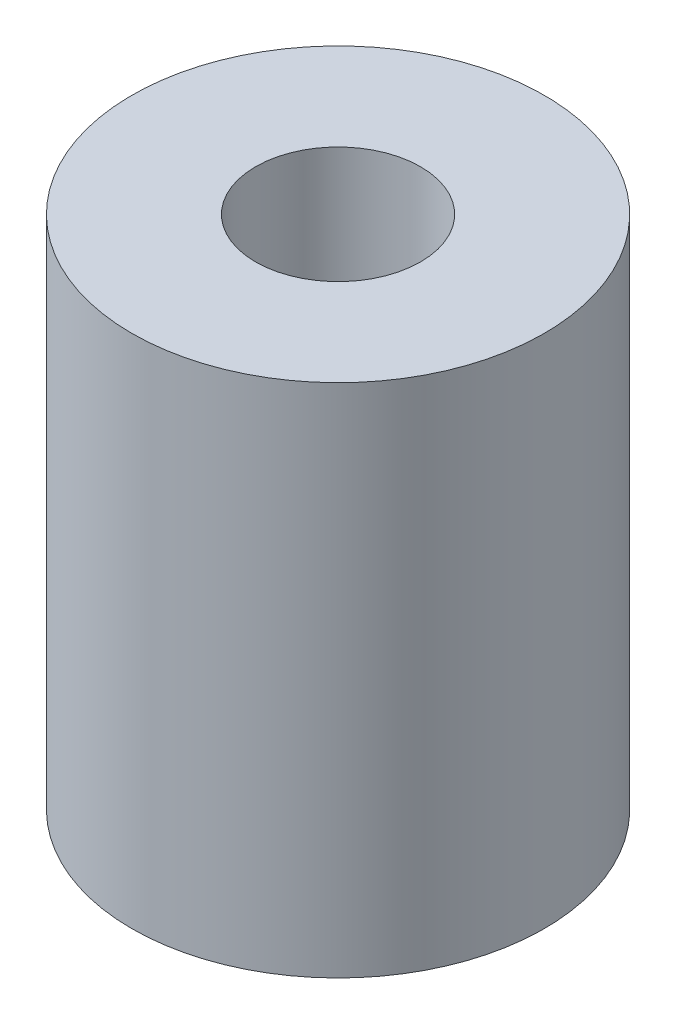
ISO-10303-21;
HEADER;
FILE_DESCRIPTION(('STEP AP214'),'2;1');
FILE_NAME('part.step','',(''),(''),'','','');
FILE_SCHEMA(('AUTOMOTIVE_DESIGN { 1 0 10303 214 1 1 1 1 }'));
ENDSEC;
DATA;
#1=APPLICATION_CONTEXT('core data for automotive mechanical design processes');
#2=APPLICATION_PROTOCOL_DEFINITION('international standard','automotive_design',2000,#1);
#3=PRODUCT_CONTEXT('',#1,'mechanical');
#4=PRODUCT('Part','Part','',(#3));
#5=PRODUCT_RELATED_PRODUCT_CATEGORY('part','',(#4));
#6=PRODUCT_DEFINITION_FORMATION('','',#4);
#7=PRODUCT_DEFINITION_CONTEXT('part definition',#1,'design');
#8=PRODUCT_DEFINITION('design','',#6,#7);
#9=PRODUCT_DEFINITION_SHAPE('','',#8);
#10=(LENGTH_UNIT() NAMED_UNIT(*) SI_UNIT(.MILLI.,.METRE.));
#11=(NAMED_UNIT(*) PLANE_ANGLE_UNIT() SI_UNIT($,.RADIAN.));
#12=(NAMED_UNIT(*) SI_UNIT($,.STERADIAN.) SOLID_ANGLE_UNIT());
#13=UNCERTAINTY_MEASURE_WITH_UNIT(LENGTH_MEASURE(1.E-05),#10,'distance_accuracy_value','');
#14=(GEOMETRIC_REPRESENTATION_CONTEXT(3) GLOBAL_UNCERTAINTY_ASSIGNED_CONTEXT((#13)) GLOBAL_UNIT_ASSIGNED_CONTEXT((#10,
#11,#12)) REPRESENTATION_CONTEXT('',''));
#15=CARTESIAN_POINT('',(0.,0.,0.));
#16=DIRECTION('',(0.,0.,1.));
#17=DIRECTION('',(1.,0.,0.));
#18=AXIS2_PLACEMENT_3D('',#15,#16,#17);
#19=CARTESIAN_POINT('',(0.,25.,0.));
#20=DIRECTION('',(0.,-1.,0.));
#21=DIRECTION('',(0.,0.,-1.));
#22=AXIS2_PLACEMENT_3D('',#19,#20,#21);
#23=CYLINDRICAL_SURFACE('',#22,10.);
#24=CARTESIAN_POINT('',(0.,25.,0.));
#25=DIRECTION('',(0.,1.,0.));
#26=DIRECTION('',(0.,0.,1.));
#27=AXIS2_PLACEMENT_3D('',#24,#25,#26);
#28=CIRCLE('',#27,10.);
#29=CARTESIAN_POINT('',(0.,25.,10.));
#30=VERTEX_POINT('',#29);
#31=EDGE_CURVE('E10',#30,#30,#28,.T.);
#32=ORIENTED_EDGE('',*,*,#31,.F.);
#33=EDGE_LOOP('',(#32));
#34=FACE_BOUND('',#33,.T.);
#35=CARTESIAN_POINT('',(0.,0.,0.));
#36=DIRECTION('',(0.,1.,0.));
#37=DIRECTION('',(0.,0.,1.));
#38=AXIS2_PLACEMENT_3D('',#35,#36,#37);
#39=CIRCLE('',#38,10.);
#40=CARTESIAN_POINT('',(0.,0.,10.));
#41=VERTEX_POINT('',#40);
#42=EDGE_CURVE('E38',#41,#41,#39,.T.);
#43=ORIENTED_EDGE('',*,*,#42,.T.);
#44=EDGE_LOOP('',(#43));
#45=FACE_BOUND('',#44,.T.);
#46=ADVANCED_FACE('F35',(#34,#45),#23,.T.);
#47=CARTESIAN_POINT('',(0.,25.,0.));
#48=DIRECTION('',(0.,1.,0.));
#49=DIRECTION('',(0.,0.,1.));
#50=AXIS2_PLACEMENT_3D('',#47,#48,#49);
#51=PLANE('',#50);
#52=CARTESIAN_POINT('',(0.,25.,0.));
#53=DIRECTION('',(0.,1.,0.));
#54=DIRECTION('',(0.,0.,1.));
#55=AXIS2_PLACEMENT_3D('',#52,#53,#54);
#56=CIRCLE('',#55,4.);
#57=CARTESIAN_POINT('',(0.,25.,4.));
#58=VERTEX_POINT('',#57);
#59=EDGE_CURVE('E47',#58,#58,#56,.T.);
#60=ORIENTED_EDGE('',*,*,#59,.F.);
#61=EDGE_LOOP('',(#60));
#62=FACE_BOUND('',#61,.T.);
#63=ORIENTED_EDGE('',*,*,#31,.T.);
#64=EDGE_LOOP('',(#63));
#65=FACE_BOUND('',#64,.T.);
#66=ADVANCED_FACE('F72',(#62,#65),#51,.T.);
#67=CARTESIAN_POINT('',(0.,0.,0.));
#68=DIRECTION('',(0.,1.,0.));
#69=DIRECTION('',(0.,0.,1.));
#70=AXIS2_PLACEMENT_3D('',#67,#68,#69);
#71=PLANE('',#70);
#72=CARTESIAN_POINT('',(0.,0.,0.));
#73=DIRECTION('',(0.,-1.,0.));
#74=DIRECTION('',(0.,0.,-1.));
#75=AXIS2_PLACEMENT_3D('',#72,#73,#74);
#76=CIRCLE('',#75,2.5);
#77=CARTESIAN_POINT('',(0.,0.,-2.5));
#78=VERTEX_POINT('',#77);
#79=EDGE_CURVE('E53',#78,#78,#76,.T.);
#80=ORIENTED_EDGE('',*,*,#79,.F.);
#81=EDGE_LOOP('',(#80));
#82=FACE_BOUND('',#81,.T.);
#83=ORIENTED_EDGE('',*,*,#42,.F.);
#84=EDGE_LOOP('',(#83));
#85=FACE_BOUND('',#84,.T.);
#86=ADVANCED_FACE('F68',(#82,#85),#71,.F.);
#87=CARTESIAN_POINT('',(0.,16.,0.));
#88=DIRECTION('',(0.,1.,0.));
#89=DIRECTION('',(0.,0.,1.));
#90=AXIS2_PLACEMENT_3D('',#87,#88,#89);
#91=CYLINDRICAL_SURFACE('',#90,4.);
#92=CARTESIAN_POINT('',(0.,16.,0.));
#93=DIRECTION('',(0.,1.,0.));
#94=DIRECTION('',(0.,0.,1.));
#95=AXIS2_PLACEMENT_3D('',#92,#93,#94);
#96=CIRCLE('',#95,4.);
#97=CARTESIAN_POINT('',(0.,16.,4.));
#98=VERTEX_POINT('',#97);
#99=EDGE_CURVE('E45',#98,#98,#96,.T.);
#100=ORIENTED_EDGE('',*,*,#99,.F.);
#101=EDGE_LOOP('',(#100));
#102=FACE_BOUND('',#101,.T.);
#103=ORIENTED_EDGE('',*,*,#59,.T.);
#104=EDGE_LOOP('',(#103));
#105=FACE_BOUND('',#104,.T.);
#106=ADVANCED_FACE('F71',(#102,#105),#91,.F.);
#107=CARTESIAN_POINT('',(0.,16.,0.));
#108=DIRECTION('',(0.,1.,0.));
#109=DIRECTION('',(0.,0.,1.));
#110=AXIS2_PLACEMENT_3D('',#107,#108,#109);
#111=PLANE('',#110);
#112=ORIENTED_EDGE('',*,*,#99,.T.);
#113=EDGE_LOOP('',(#112));
#114=FACE_BOUND('',#113,.T.);
#115=ADVANCED_FACE('F64',(#114),#111,.T.);
#116=CARTESIAN_POINT('',(0.,11.,0.));
#117=DIRECTION('',(0.,-1.,0.));
#118=DIRECTION('',(0.,0.,-1.));
#119=AXIS2_PLACEMENT_3D('',#116,#117,#118);
#120=CYLINDRICAL_SURFACE('',#119,2.5);
#121=CARTESIAN_POINT('',(0.,11.,0.));
#122=DIRECTION('',(0.,-1.,0.));
#123=DIRECTION('',(0.,0.,-1.));
#124=AXIS2_PLACEMENT_3D('',#121,#122,#123);
#125=CIRCLE('',#124,2.5);
#126=CARTESIAN_POINT('',(0.,11.,-2.5));
#127=VERTEX_POINT('',#126);
#128=EDGE_CURVE('E50',#127,#127,#125,.T.);
#129=ORIENTED_EDGE('',*,*,#128,.F.);
#130=EDGE_LOOP('',(#129));
#131=FACE_BOUND('',#130,.T.);
#132=ORIENTED_EDGE('',*,*,#79,.T.);
#133=EDGE_LOOP('',(#132));
#134=FACE_BOUND('',#133,.T.);
#135=ADVANCED_FACE('F61',(#131,#134),#120,.F.);
#136=CARTESIAN_POINT('',(0.,11.,0.));
#137=DIRECTION('',(0.,-1.,0.));
#138=DIRECTION('',(0.,0.,-1.));
#139=AXIS2_PLACEMENT_3D('',#136,#137,#138);
#140=PLANE('',#139);
#141=ORIENTED_EDGE('',*,*,#128,.T.);
#142=EDGE_LOOP('',(#141));
#143=FACE_BOUND('',#142,.T.);
#144=ADVANCED_FACE('F59',(#143),#140,.T.);
#145=CLOSED_SHELL('',(#46,#66,#86,#106,#115,#135,#144));
#146=MANIFOLD_SOLID_BREP('B2',#145);
#147=ADVANCED_BREP_SHAPE_REPRESENTATION('',(#18,#146),#14);
#148=SHAPE_DEFINITION_REPRESENTATION(#9,#147);
ENDSEC;
END-ISO-10303-21;
